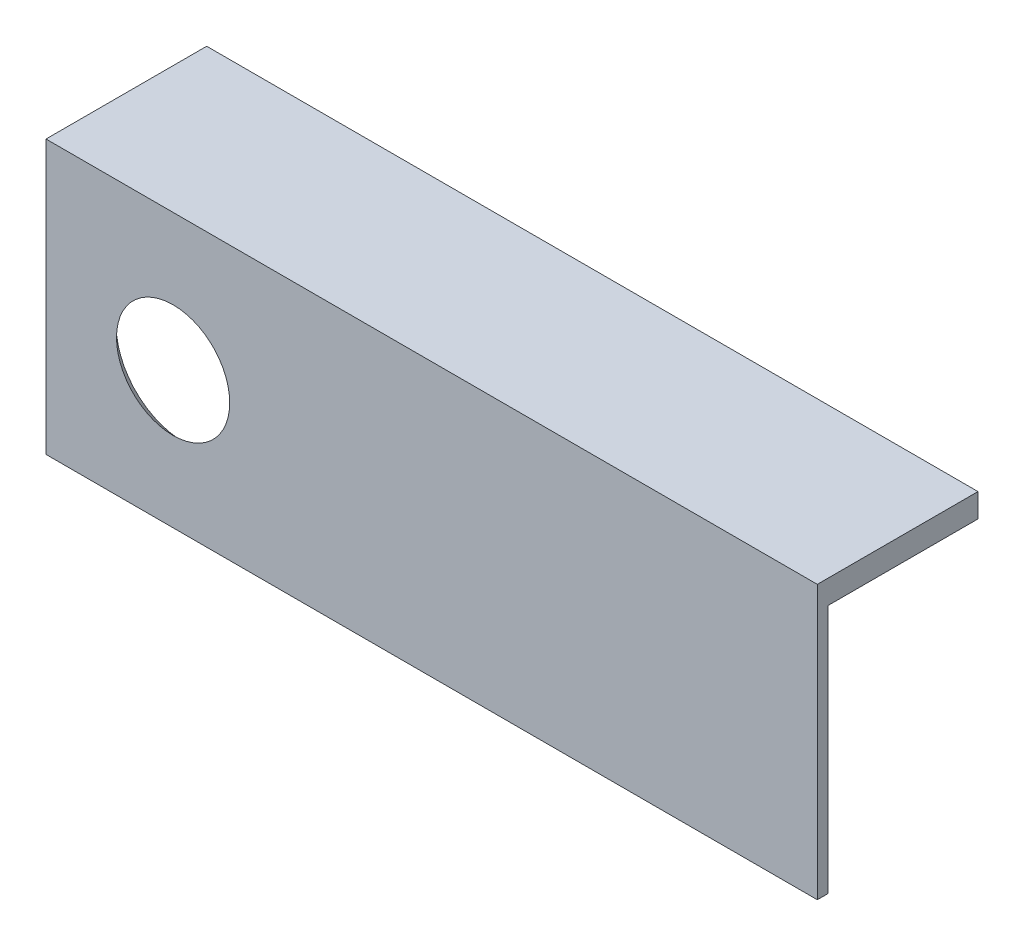
ISO-10303-21;
HEADER;
FILE_DESCRIPTION(('STEP AP214'),'2;1');
FILE_NAME('part.step','',(''),(''),'','','');
FILE_SCHEMA(('AUTOMOTIVE_DESIGN { 1 0 10303 214 1 1 1 1 }'));
ENDSEC;
DATA;
#1=APPLICATION_CONTEXT('core data for automotive mechanical design processes');
#2=APPLICATION_PROTOCOL_DEFINITION('international standard','automotive_design',2000,#1);
#3=PRODUCT_CONTEXT('',#1,'mechanical');
#4=PRODUCT('Part','Part','',(#3));
#5=PRODUCT_RELATED_PRODUCT_CATEGORY('part','',(#4));
#6=PRODUCT_DEFINITION_FORMATION('','',#4);
#7=PRODUCT_DEFINITION_CONTEXT('part definition',#1,'design');
#8=PRODUCT_DEFINITION('design','',#6,#7);
#9=PRODUCT_DEFINITION_SHAPE('','',#8);
#10=(LENGTH_UNIT() NAMED_UNIT(*) SI_UNIT(.MILLI.,.METRE.));
#11=(NAMED_UNIT(*) PLANE_ANGLE_UNIT() SI_UNIT($,.RADIAN.));
#12=(NAMED_UNIT(*) SI_UNIT($,.STERADIAN.) SOLID_ANGLE_UNIT());
#13=UNCERTAINTY_MEASURE_WITH_UNIT(LENGTH_MEASURE(1.E-05),#10,'distance_accuracy_value','');
#14=(GEOMETRIC_REPRESENTATION_CONTEXT(3) GLOBAL_UNCERTAINTY_ASSIGNED_CONTEXT((#13)) GLOBAL_UNIT_ASSIGNED_CONTEXT((#10,
#11,#12)) REPRESENTATION_CONTEXT('',''));
#15=CARTESIAN_POINT('',(0.,0.,0.));
#16=DIRECTION('',(0.,0.,1.));
#17=DIRECTION('',(1.,0.,0.));
#18=AXIS2_PLACEMENT_3D('',#15,#16,#17);
#19=CARTESIAN_POINT('',(24.,8.5,10.));
#20=DIRECTION('',(-1.,0.,0.));
#21=DIRECTION('',(0.,-1.,0.));
#22=AXIS2_PLACEMENT_3D('',#19,#20,#21);
#23=PLANE('',#22);
#24=DIRECTION('',(0.,1.,0.));
#25=VECTOR('',#24,1.);
#26=CARTESIAN_POINT('',(24.,7.02418619284928,9.346110156475));
#27=LINE('',#26,#25);
#28=CARTESIAN_POINT('',(24.,-8.49999999999999,9.346110156475));
#29=VERTEX_POINT('',#28);
#30=CARTESIAN_POINT('',(24.,7.02418619284928,9.346110156475));
#31=VERTEX_POINT('',#30);
#32=EDGE_CURVE('E96',#29,#31,#27,.T.);
#33=ORIENTED_EDGE('',*,*,#32,.T.);
#34=DIRECTION('',(0.,0.,-1.));
#35=VECTOR('',#34,1.);
#36=CARTESIAN_POINT('',(24.,7.02418619284928,0.));
#37=LINE('',#36,#35);
#38=CARTESIAN_POINT('',(24.,7.02418619284928,0.));
#39=VERTEX_POINT('',#38);
#40=EDGE_CURVE('E107',#31,#39,#37,.T.);
#41=ORIENTED_EDGE('',*,*,#40,.T.);
#42=DIRECTION('',(0.,1.,0.));
#43=VECTOR('',#42,1.);
#44=CARTESIAN_POINT('',(24.,8.5,0.));
#45=LINE('',#44,#43);
#46=CARTESIAN_POINT('',(24.,8.5,0.));
#47=VERTEX_POINT('',#46);
#48=EDGE_CURVE('E137',#39,#47,#45,.T.);
#49=ORIENTED_EDGE('',*,*,#48,.T.);
#50=DIRECTION('',(0.,0.,-1.));
#51=VECTOR('',#50,1.);
#52=CARTESIAN_POINT('',(24.,8.5,10.));
#53=LINE('',#52,#51);
#54=CARTESIAN_POINT('',(24.,8.5,10.));
#55=VERTEX_POINT('',#54);
#56=EDGE_CURVE('E11',#55,#47,#53,.T.);
#57=ORIENTED_EDGE('',*,*,#56,.F.);
#58=DIRECTION('',(0.,1.,0.));
#59=VECTOR('',#58,1.);
#60=CARTESIAN_POINT('',(24.,8.5,10.));
#61=LINE('',#60,#59);
#62=CARTESIAN_POINT('',(24.,-8.5,10.));
#63=VERTEX_POINT('',#62);
#64=EDGE_CURVE('E118',#63,#55,#61,.T.);
#65=ORIENTED_EDGE('',*,*,#64,.F.);
#66=DIRECTION('',(0.,0.,-1.));
#67=VECTOR('',#66,1.);
#68=CARTESIAN_POINT('',(24.,-8.5,10.));
#69=LINE('',#68,#67);
#70=EDGE_CURVE('E112',#63,#29,#69,.T.);
#71=ORIENTED_EDGE('',*,*,#70,.T.);
#72=EDGE_LOOP('',(#33,#41,#49,#57,#65,#71));
#73=FACE_BOUND('',#72,.T.);
#74=ADVANCED_FACE('F37',(#73),#23,.F.);
#75=CARTESIAN_POINT('',(-24.,8.5,10.));
#76=DIRECTION('',(0.,-1.,0.));
#77=DIRECTION('',(0.,0.,-1.));
#78=AXIS2_PLACEMENT_3D('',#75,#76,#77);
#79=PLANE('',#78);
#80=DIRECTION('',(-1.,0.,0.));
#81=VECTOR('',#80,1.);
#82=CARTESIAN_POINT('',(-24.,8.5,0.));
#83=LINE('',#82,#81);
#84=CARTESIAN_POINT('',(-24.,8.5,0.));
#85=VERTEX_POINT('',#84);
#86=EDGE_CURVE('E76',#47,#85,#83,.T.);
#87=ORIENTED_EDGE('',*,*,#86,.T.);
#88=DIRECTION('',(0.,0.,-1.));
#89=VECTOR('',#88,1.);
#90=CARTESIAN_POINT('',(-24.,8.5,10.));
#91=LINE('',#90,#89);
#92=CARTESIAN_POINT('',(-24.,8.5,10.));
#93=VERTEX_POINT('',#92);
#94=EDGE_CURVE('E45',#93,#85,#91,.T.);
#95=ORIENTED_EDGE('',*,*,#94,.F.);
#96=DIRECTION('',(-1.,0.,0.));
#97=VECTOR('',#96,1.);
#98=CARTESIAN_POINT('',(-24.,8.5,10.));
#99=LINE('',#98,#97);
#100=EDGE_CURVE('E81',#55,#93,#99,.T.);
#101=ORIENTED_EDGE('',*,*,#100,.F.);
#102=ORIENTED_EDGE('',*,*,#56,.T.);
#103=EDGE_LOOP('',(#87,#95,#101,#102));
#104=FACE_BOUND('',#103,.T.);
#105=ADVANCED_FACE('F160',(#104),#79,.F.);
#106=CARTESIAN_POINT('',(-24.,8.5,10.));
#107=DIRECTION('',(1.,0.,0.));
#108=DIRECTION('',(0.,1.,0.));
#109=AXIS2_PLACEMENT_3D('',#106,#107,#108);
#110=PLANE('',#109);
#111=DIRECTION('',(0.,-1.,0.));
#112=VECTOR('',#111,1.);
#113=CARTESIAN_POINT('',(-24.,8.5,0.));
#114=LINE('',#113,#112);
#115=CARTESIAN_POINT('',(-24.,7.02418619284927,0.));
#116=VERTEX_POINT('',#115);
#117=EDGE_CURVE('E124',#85,#116,#114,.T.);
#118=ORIENTED_EDGE('',*,*,#117,.T.);
#119=DIRECTION('',(0.,0.,-1.));
#120=VECTOR('',#119,1.);
#121=CARTESIAN_POINT('',(-24.,7.02418619284927,0.));
#122=LINE('',#121,#120);
#123=CARTESIAN_POINT('',(-24.,7.02418619284927,9.346110156475));
#124=VERTEX_POINT('',#123);
#125=EDGE_CURVE('E52',#124,#116,#122,.T.);
#126=ORIENTED_EDGE('',*,*,#125,.F.);
#127=DIRECTION('',(0.,1.,0.));
#128=VECTOR('',#127,1.);
#129=CARTESIAN_POINT('',(-24.,7.02418619284927,9.346110156475));
#130=LINE('',#129,#128);
#131=CARTESIAN_POINT('',(-24.,-8.5,9.346110156475));
#132=VERTEX_POINT('',#131);
#133=EDGE_CURVE('E145',#132,#124,#130,.T.);
#134=ORIENTED_EDGE('',*,*,#133,.F.);
#135=DIRECTION('',(0.,0.,-1.));
#136=VECTOR('',#135,1.);
#137=CARTESIAN_POINT('',(-24.,-8.5,10.));
#138=LINE('',#137,#136);
#139=CARTESIAN_POINT('',(-24.,-8.5,10.));
#140=VERTEX_POINT('',#139);
#141=EDGE_CURVE('E115',#140,#132,#138,.T.);
#142=ORIENTED_EDGE('',*,*,#141,.F.);
#143=DIRECTION('',(0.,-1.,0.));
#144=VECTOR('',#143,1.);
#145=CARTESIAN_POINT('',(-24.,8.5,10.));
#146=LINE('',#145,#144);
#147=EDGE_CURVE('E121',#93,#140,#146,.T.);
#148=ORIENTED_EDGE('',*,*,#147,.F.);
#149=ORIENTED_EDGE('',*,*,#94,.T.);
#150=EDGE_LOOP('',(#118,#126,#134,#142,#148,#149));
#151=FACE_BOUND('',#150,.T.);
#152=ADVANCED_FACE('F131',(#151),#110,.F.);
#153=CARTESIAN_POINT('',(-24.,-8.5,10.));
#154=DIRECTION('',(0.,1.,0.));
#155=DIRECTION('',(0.,0.,1.));
#156=AXIS2_PLACEMENT_3D('',#153,#154,#155);
#157=PLANE('',#156);
#158=ORIENTED_EDGE('',*,*,#141,.T.);
#159=DIRECTION('',(-1.,0.,0.));
#160=VECTOR('',#159,1.);
#161=CARTESIAN_POINT('',(24.,-8.49999999999999,9.346110156475));
#162=LINE('',#161,#160);
#163=EDGE_CURVE('E100',#29,#132,#162,.T.);
#164=ORIENTED_EDGE('',*,*,#163,.F.);
#165=ORIENTED_EDGE('',*,*,#70,.F.);
#166=DIRECTION('',(1.,0.,0.));
#167=VECTOR('',#166,1.);
#168=CARTESIAN_POINT('',(-24.,-8.5,10.));
#169=LINE('',#168,#167);
#170=EDGE_CURVE('E61',#140,#63,#169,.T.);
#171=ORIENTED_EDGE('',*,*,#170,.F.);
#172=EDGE_LOOP('',(#158,#164,#165,#171));
#173=FACE_BOUND('',#172,.T.);
#174=ADVANCED_FACE('F111',(#173),#157,.F.);
#175=CARTESIAN_POINT('',(0.,0.,10.));
#176=DIRECTION('',(0.,0.,1.));
#177=DIRECTION('',(1.,0.,0.));
#178=AXIS2_PLACEMENT_3D('',#175,#176,#177);
#179=PLANE('',#178);
#180=CARTESIAN_POINT('',(-16.0902801938114,0.,10.));
#181=DIRECTION('',(0.,0.,1.));
#182=DIRECTION('',(1.,0.,0.));
#183=AXIS2_PLACEMENT_3D('',#180,#181,#182);
#184=CIRCLE('',#183,3.52287724515009);
#185=CARTESIAN_POINT('',(-12.5674029486613,0.,10.));
#186=VERTEX_POINT('',#185);
#187=EDGE_CURVE('E40',#186,#186,#184,.T.);
#188=ORIENTED_EDGE('',*,*,#187,.F.);
#189=EDGE_LOOP('',(#188));
#190=FACE_BOUND('',#189,.T.);
#191=ORIENTED_EDGE('',*,*,#64,.T.);
#192=ORIENTED_EDGE('',*,*,#100,.T.);
#193=ORIENTED_EDGE('',*,*,#147,.T.);
#194=ORIENTED_EDGE('',*,*,#170,.T.);
#195=EDGE_LOOP('',(#191,#192,#193,#194));
#196=FACE_BOUND('',#195,.T.);
#197=ADVANCED_FACE('F157',(#190,#196),#179,.T.);
#198=CARTESIAN_POINT('',(0.,0.,0.));
#199=DIRECTION('',(0.,0.,1.));
#200=DIRECTION('',(1.,0.,0.));
#201=AXIS2_PLACEMENT_3D('',#198,#199,#200);
#202=PLANE('',#201);
#203=ORIENTED_EDGE('',*,*,#48,.F.);
#204=DIRECTION('',(-1.,0.,0.));
#205=VECTOR('',#204,1.);
#206=CARTESIAN_POINT('',(24.,7.02418619284928,0.));
#207=LINE('',#206,#205);
#208=EDGE_CURVE('E135',#39,#116,#207,.T.);
#209=ORIENTED_EDGE('',*,*,#208,.T.);
#210=ORIENTED_EDGE('',*,*,#117,.F.);
#211=ORIENTED_EDGE('',*,*,#86,.F.);
#212=EDGE_LOOP('',(#203,#209,#210,#211));
#213=FACE_BOUND('',#212,.T.);
#214=ADVANCED_FACE('F134',(#213),#202,.F.);
#215=CARTESIAN_POINT('',(24.,7.02418619284928,0.));
#216=DIRECTION('',(0.,1.,0.));
#217=DIRECTION('',(-1.,0.,0.));
#218=AXIS2_PLACEMENT_3D('',#215,#216,#217);
#219=PLANE('',#218);
#220=ORIENTED_EDGE('',*,*,#125,.T.);
#221=ORIENTED_EDGE('',*,*,#208,.F.);
#222=ORIENTED_EDGE('',*,*,#40,.F.);
#223=DIRECTION('',(-1.,0.,0.));
#224=VECTOR('',#223,1.);
#225=CARTESIAN_POINT('',(24.,7.02418619284928,9.346110156475));
#226=LINE('',#225,#224);
#227=EDGE_CURVE('E102',#31,#124,#226,.T.);
#228=ORIENTED_EDGE('',*,*,#227,.T.);
#229=EDGE_LOOP('',(#220,#221,#222,#228));
#230=FACE_BOUND('',#229,.T.);
#231=ADVANCED_FACE('F171',(#230),#219,.F.);
#232=CARTESIAN_POINT('',(24.,7.02418619284928,9.346110156475));
#233=DIRECTION('',(0.,0.,1.));
#234=DIRECTION('',(1.,0.,0.));
#235=AXIS2_PLACEMENT_3D('',#232,#233,#234);
#236=PLANE('',#235);
#237=CARTESIAN_POINT('',(-16.0902801938114,0.,9.346110156475));
#238=DIRECTION('',(0.,0.,-1.));
#239=DIRECTION('',(-1.,0.,0.));
#240=AXIS2_PLACEMENT_3D('',#237,#238,#239);
#241=CIRCLE('',#240,4.2);
#242=CARTESIAN_POINT('',(-20.2902801938114,0.,9.346110156475));
#243=VERTEX_POINT('',#242);
#244=EDGE_CURVE('E148',#243,#243,#241,.T.);
#245=ORIENTED_EDGE('',*,*,#244,.F.);
#246=EDGE_LOOP('',(#245));
#247=FACE_BOUND('',#246,.T.);
#248=ORIENTED_EDGE('',*,*,#133,.T.);
#249=ORIENTED_EDGE('',*,*,#227,.F.);
#250=ORIENTED_EDGE('',*,*,#32,.F.);
#251=ORIENTED_EDGE('',*,*,#163,.T.);
#252=EDGE_LOOP('',(#248,#249,#250,#251));
#253=FACE_BOUND('',#252,.T.);
#254=ADVANCED_FACE('F99',(#247,#253),#236,.F.);
#255=CARTESIAN_POINT('',(-16.0902801938114,0.,9.346110156475));
#256=DIRECTION('',(0.,0.,-1.));
#257=DIRECTION('',(-1.,0.,0.));
#258=AXIS2_PLACEMENT_3D('',#255,#256,#257);
#259=CONICAL_SURFACE('',#258,4.2,0.802851455917392);
#260=ORIENTED_EDGE('',*,*,#187,.T.);
#261=EDGE_LOOP('',(#260));
#262=FACE_BOUND('',#261,.T.);
#263=ORIENTED_EDGE('',*,*,#244,.T.);
#264=EDGE_LOOP('',(#263));
#265=FACE_BOUND('',#264,.T.);
#266=ADVANCED_FACE('F155',(#262,#265),#259,.F.);
#267=CLOSED_SHELL('',(#74,#105,#152,#174,#197,#214,#231,#254,#266));
#268=MANIFOLD_SOLID_BREP('B2',#267);
#269=ADVANCED_BREP_SHAPE_REPRESENTATION('',(#18,#268),#14);
#270=SHAPE_DEFINITION_REPRESENTATION(#9,#269);
ENDSEC;
END-ISO-10303-21;
